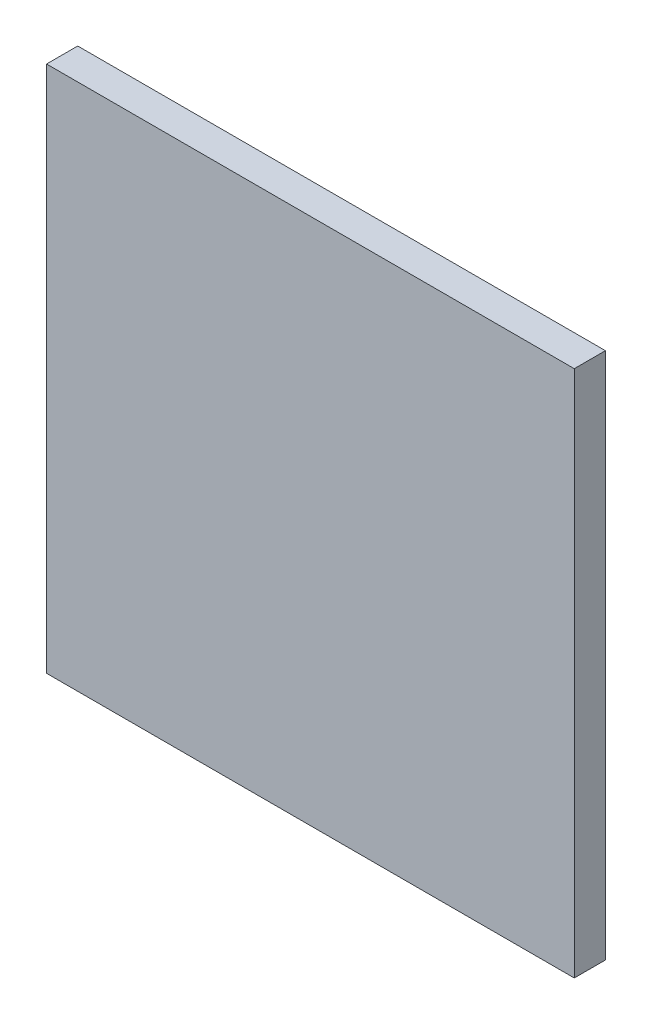
ISO-10303-21;
HEADER;
FILE_DESCRIPTION(('STEP AP214'),'2;1');
FILE_NAME('part.step','',(''),(''),'','','');
FILE_SCHEMA(('AUTOMOTIVE_DESIGN { 1 0 10303 214 1 1 1 1 }'));
ENDSEC;
DATA;
#1=APPLICATION_CONTEXT('core data for automotive mechanical design processes');
#2=APPLICATION_PROTOCOL_DEFINITION('international standard','automotive_design',2000,#1);
#3=PRODUCT_CONTEXT('',#1,'mechanical');
#4=PRODUCT('Part','Part','',(#3));
#5=PRODUCT_RELATED_PRODUCT_CATEGORY('part','',(#4));
#6=PRODUCT_DEFINITION_FORMATION('','',#4);
#7=PRODUCT_DEFINITION_CONTEXT('part definition',#1,'design');
#8=PRODUCT_DEFINITION('design','',#6,#7);
#9=PRODUCT_DEFINITION_SHAPE('','',#8);
#10=(LENGTH_UNIT() NAMED_UNIT(*) SI_UNIT(.MILLI.,.METRE.));
#11=(NAMED_UNIT(*) PLANE_ANGLE_UNIT() SI_UNIT($,.RADIAN.));
#12=(NAMED_UNIT(*) SI_UNIT($,.STERADIAN.) SOLID_ANGLE_UNIT());
#13=UNCERTAINTY_MEASURE_WITH_UNIT(LENGTH_MEASURE(1.E-05),#10,'distance_accuracy_value','');
#14=(GEOMETRIC_REPRESENTATION_CONTEXT(3) GLOBAL_UNCERTAINTY_ASSIGNED_CONTEXT((#13)) GLOBAL_UNIT_ASSIGNED_CONTEXT((#10,
#11,#12)) REPRESENTATION_CONTEXT('',''));
#15=CARTESIAN_POINT('',(0.,0.,0.));
#16=DIRECTION('',(0.,0.,1.));
#17=DIRECTION('',(1.,0.,0.));
#18=AXIS2_PLACEMENT_3D('',#15,#16,#17);
#19=CARTESIAN_POINT('',(50.8,-50.8,6.));
#20=DIRECTION('',(-1.,0.,0.));
#21=DIRECTION('',(0.,0.,1.));
#22=AXIS2_PLACEMENT_3D('',#19,#20,#21);
#23=PLANE('',#22);
#24=DIRECTION('',(0.,1.,0.));
#25=VECTOR('',#24,1.);
#26=CARTESIAN_POINT('',(50.8,-50.8,0.));
#27=LINE('',#26,#25);
#28=CARTESIAN_POINT('',(50.8,-50.8,0.));
#29=VERTEX_POINT('',#28);
#30=CARTESIAN_POINT('',(50.8,50.8,0.));
#31=VERTEX_POINT('',#30);
#32=EDGE_CURVE('E97',#29,#31,#27,.T.);
#33=ORIENTED_EDGE('',*,*,#32,.T.);
#34=DIRECTION('',(0.,0.,-1.));
#35=VECTOR('',#34,1.);
#36=CARTESIAN_POINT('',(50.8,50.8,6.));
#37=LINE('',#36,#35);
#38=CARTESIAN_POINT('',(50.8,50.8,6.));
#39=VERTEX_POINT('',#38);
#40=EDGE_CURVE('E11',#39,#31,#37,.T.);
#41=ORIENTED_EDGE('',*,*,#40,.F.);
#42=DIRECTION('',(0.,1.,0.));
#43=VECTOR('',#42,1.);
#44=CARTESIAN_POINT('',(50.8,-50.8,6.));
#45=LINE('',#44,#43);
#46=CARTESIAN_POINT('',(50.8,-50.8,6.));
#47=VERTEX_POINT('',#46);
#48=EDGE_CURVE('E85',#47,#39,#45,.T.);
#49=ORIENTED_EDGE('',*,*,#48,.F.);
#50=DIRECTION('',(0.,0.,-1.));
#51=VECTOR('',#50,1.);
#52=CARTESIAN_POINT('',(50.8,-50.8,6.));
#53=LINE('',#52,#51);
#54=EDGE_CURVE('E93',#47,#29,#53,.T.);
#55=ORIENTED_EDGE('',*,*,#54,.T.);
#56=EDGE_LOOP('',(#33,#41,#49,#55));
#57=FACE_BOUND('',#56,.T.);
#58=ADVANCED_FACE('F34',(#57),#23,.F.);
#59=CARTESIAN_POINT('',(-50.8,50.8,6.));
#60=DIRECTION('',(0.,-1.,0.));
#61=DIRECTION('',(0.,0.,-1.));
#62=AXIS2_PLACEMENT_3D('',#59,#60,#61);
#63=PLANE('',#62);
#64=DIRECTION('',(-1.,0.,0.));
#65=VECTOR('',#64,1.);
#66=CARTESIAN_POINT('',(-50.8,50.8,0.));
#67=LINE('',#66,#65);
#68=CARTESIAN_POINT('',(-50.8,50.8,0.));
#69=VERTEX_POINT('',#68);
#70=EDGE_CURVE('E89',#31,#69,#67,.T.);
#71=ORIENTED_EDGE('',*,*,#70,.T.);
#72=DIRECTION('',(0.,0.,-1.));
#73=VECTOR('',#72,1.);
#74=CARTESIAN_POINT('',(-50.8,50.8,6.));
#75=LINE('',#74,#73);
#76=CARTESIAN_POINT('',(-50.8,50.8,6.));
#77=VERTEX_POINT('',#76);
#78=EDGE_CURVE('E42',#77,#69,#75,.T.);
#79=ORIENTED_EDGE('',*,*,#78,.F.);
#80=DIRECTION('',(-1.,0.,0.));
#81=VECTOR('',#80,1.);
#82=CARTESIAN_POINT('',(-50.8,50.8,6.));
#83=LINE('',#82,#81);
#84=EDGE_CURVE('E80',#39,#77,#83,.T.);
#85=ORIENTED_EDGE('',*,*,#84,.F.);
#86=ORIENTED_EDGE('',*,*,#40,.T.);
#87=EDGE_LOOP('',(#71,#79,#85,#86));
#88=FACE_BOUND('',#87,.T.);
#89=ADVANCED_FACE('F88',(#88),#63,.F.);
#90=CARTESIAN_POINT('',(-50.8,-50.8,6.));
#91=DIRECTION('',(1.,0.,0.));
#92=DIRECTION('',(0.,0.,-1.));
#93=AXIS2_PLACEMENT_3D('',#90,#91,#92);
#94=PLANE('',#93);
#95=DIRECTION('',(0.,-1.,0.));
#96=VECTOR('',#95,1.);
#97=CARTESIAN_POINT('',(-50.8,-50.8,0.));
#98=LINE('',#97,#96);
#99=CARTESIAN_POINT('',(-50.8,-50.8,0.));
#100=VERTEX_POINT('',#99);
#101=EDGE_CURVE('E67',#69,#100,#98,.T.);
#102=ORIENTED_EDGE('',*,*,#101,.T.);
#103=DIRECTION('',(0.,0.,-1.));
#104=VECTOR('',#103,1.);
#105=CARTESIAN_POINT('',(-50.8,-50.8,6.));
#106=LINE('',#105,#104);
#107=CARTESIAN_POINT('',(-50.8,-50.8,6.));
#108=VERTEX_POINT('',#107);
#109=EDGE_CURVE('E90',#108,#100,#106,.T.);
#110=ORIENTED_EDGE('',*,*,#109,.F.);
#111=DIRECTION('',(0.,-1.,0.));
#112=VECTOR('',#111,1.);
#113=CARTESIAN_POINT('',(-50.8,-50.8,6.));
#114=LINE('',#113,#112);
#115=EDGE_CURVE('E83',#77,#108,#114,.T.);
#116=ORIENTED_EDGE('',*,*,#115,.F.);
#117=ORIENTED_EDGE('',*,*,#78,.T.);
#118=EDGE_LOOP('',(#102,#110,#116,#117));
#119=FACE_BOUND('',#118,.T.);
#120=ADVANCED_FACE('F91',(#119),#94,.F.);
#121=CARTESIAN_POINT('',(-50.8,-50.8,6.));
#122=DIRECTION('',(0.,1.,0.));
#123=DIRECTION('',(0.,0.,1.));
#124=AXIS2_PLACEMENT_3D('',#121,#122,#123);
#125=PLANE('',#124);
#126=DIRECTION('',(1.,0.,0.));
#127=VECTOR('',#126,1.);
#128=CARTESIAN_POINT('',(-50.8,-50.8,0.));
#129=LINE('',#128,#127);
#130=EDGE_CURVE('E73',#100,#29,#129,.T.);
#131=ORIENTED_EDGE('',*,*,#130,.T.);
#132=ORIENTED_EDGE('',*,*,#54,.F.);
#133=DIRECTION('',(1.,0.,0.));
#134=VECTOR('',#133,1.);
#135=CARTESIAN_POINT('',(-50.8,-50.8,6.));
#136=LINE('',#135,#134);
#137=EDGE_CURVE('E50',#108,#47,#136,.T.);
#138=ORIENTED_EDGE('',*,*,#137,.F.);
#139=ORIENTED_EDGE('',*,*,#109,.T.);
#140=EDGE_LOOP('',(#131,#132,#138,#139));
#141=FACE_BOUND('',#140,.T.);
#142=ADVANCED_FACE('F104',(#141),#125,.F.);
#143=CARTESIAN_POINT('',(0.,0.,6.));
#144=DIRECTION('',(0.,0.,-1.));
#145=DIRECTION('',(-1.,0.,0.));
#146=AXIS2_PLACEMENT_3D('',#143,#144,#145);
#147=PLANE('',#146);
#148=ORIENTED_EDGE('',*,*,#48,.T.);
#149=ORIENTED_EDGE('',*,*,#84,.T.);
#150=ORIENTED_EDGE('',*,*,#115,.T.);
#151=ORIENTED_EDGE('',*,*,#137,.T.);
#152=EDGE_LOOP('',(#148,#149,#150,#151));
#153=FACE_BOUND('',#152,.T.);
#154=ADVANCED_FACE('F81',(#153),#147,.F.);
#155=CARTESIAN_POINT('',(0.,0.,0.));
#156=DIRECTION('',(0.,0.,-1.));
#157=DIRECTION('',(-1.,0.,0.));
#158=AXIS2_PLACEMENT_3D('',#155,#156,#157);
#159=PLANE('',#158);
#160=ORIENTED_EDGE('',*,*,#32,.F.);
#161=ORIENTED_EDGE('',*,*,#130,.F.);
#162=ORIENTED_EDGE('',*,*,#101,.F.);
#163=ORIENTED_EDGE('',*,*,#70,.F.);
#164=EDGE_LOOP('',(#160,#161,#162,#163));
#165=FACE_BOUND('',#164,.T.);
#166=ADVANCED_FACE('F107',(#165),#159,.T.);
#167=CLOSED_SHELL('',(#58,#89,#120,#142,#154,#166));
#168=MANIFOLD_SOLID_BREP('B2',#167);
#169=ADVANCED_BREP_SHAPE_REPRESENTATION('',(#18,#168),#14);
#170=SHAPE_DEFINITION_REPRESENTATION(#9,#169);
ENDSEC;
END-ISO-10303-21;
